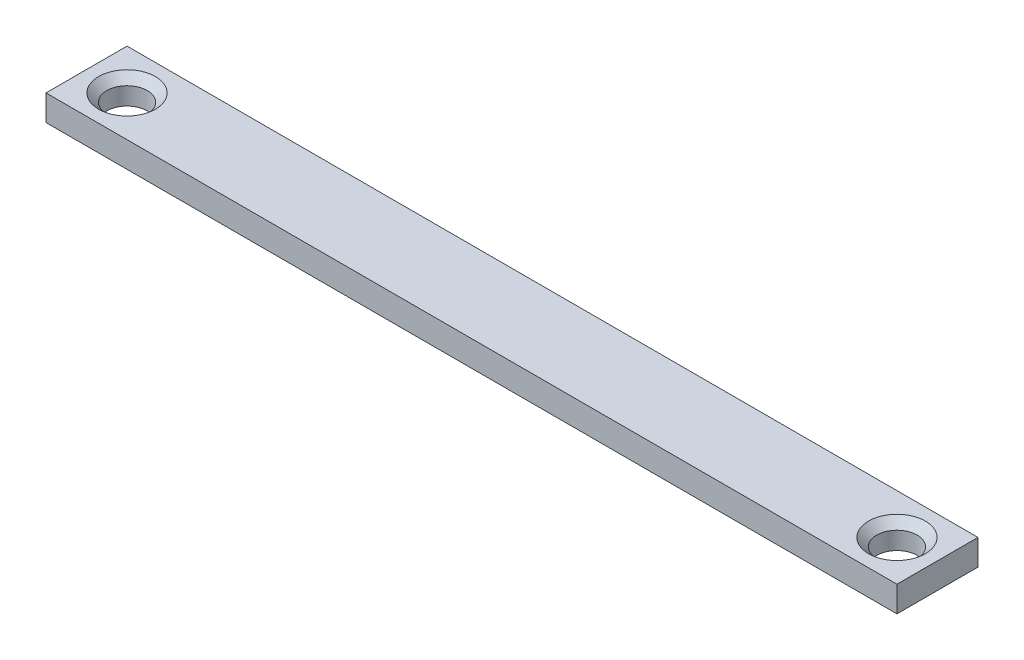
ISO-10303-21;
HEADER;
FILE_DESCRIPTION(('STEP AP214'),'2;1');
FILE_NAME('part.step','',(''),(''),'','','');
FILE_SCHEMA(('AUTOMOTIVE_DESIGN { 1 0 10303 214 1 1 1 1 }'));
ENDSEC;
DATA;
#1=APPLICATION_CONTEXT('core data for automotive mechanical design processes');
#2=APPLICATION_PROTOCOL_DEFINITION('international standard','automotive_design',2000,#1);
#3=PRODUCT_CONTEXT('',#1,'mechanical');
#4=PRODUCT('Part','Part','',(#3));
#5=PRODUCT_RELATED_PRODUCT_CATEGORY('part','',(#4));
#6=PRODUCT_DEFINITION_FORMATION('','',#4);
#7=PRODUCT_DEFINITION_CONTEXT('part definition',#1,'design');
#8=PRODUCT_DEFINITION('design','',#6,#7);
#9=PRODUCT_DEFINITION_SHAPE('','',#8);
#10=(LENGTH_UNIT() NAMED_UNIT(*) SI_UNIT(.MILLI.,.METRE.));
#11=(NAMED_UNIT(*) PLANE_ANGLE_UNIT() SI_UNIT($,.RADIAN.));
#12=(NAMED_UNIT(*) SI_UNIT($,.STERADIAN.) SOLID_ANGLE_UNIT());
#13=UNCERTAINTY_MEASURE_WITH_UNIT(LENGTH_MEASURE(1.E-05),#10,'distance_accuracy_value','');
#14=(GEOMETRIC_REPRESENTATION_CONTEXT(3) GLOBAL_UNCERTAINTY_ASSIGNED_CONTEXT((#13)) GLOBAL_UNIT_ASSIGNED_CONTEXT((#10,
#11,#12)) REPRESENTATION_CONTEXT('',''));
#15=CARTESIAN_POINT('',(0.,0.,0.));
#16=DIRECTION('',(0.,0.,1.));
#17=DIRECTION('',(1.,0.,0.));
#18=AXIS2_PLACEMENT_3D('',#15,#16,#17);
#19=CARTESIAN_POINT('',(0.,3.175,0.));
#20=DIRECTION('',(0.,-1.,0.));
#21=DIRECTION('',(0.,0.,-1.));
#22=AXIS2_PLACEMENT_3D('',#19,#20,#21);
#23=PLANE('',#22);
#24=CARTESIAN_POINT('',(47.5,3.175,0.));
#25=DIRECTION('',(0.,1.,0.));
#26=DIRECTION('',(0.,0.,1.));
#27=AXIS2_PLACEMENT_3D('',#24,#25,#26);
#28=CIRCLE('',#27,3.5);
#29=CARTESIAN_POINT('',(47.5,3.175,3.49999999999999));
#30=VERTEX_POINT('',#29);
#31=EDGE_CURVE('E140',#30,#30,#28,.T.);
#32=ORIENTED_EDGE('',*,*,#31,.F.);
#33=EDGE_LOOP('',(#32));
#34=FACE_BOUND('',#33,.T.);
#35=DIRECTION('',(0.,0.,-1.));
#36=VECTOR('',#35,1.);
#37=CARTESIAN_POINT('',(52.5,3.175,5.));
#38=LINE('',#37,#36);
#39=CARTESIAN_POINT('',(52.5,3.175,5.));
#40=VERTEX_POINT('',#39);
#41=CARTESIAN_POINT('',(52.5,3.175,-5.));
#42=VERTEX_POINT('',#41);
#43=EDGE_CURVE('E96',#40,#42,#38,.T.);
#44=ORIENTED_EDGE('',*,*,#43,.T.);
#45=DIRECTION('',(-1.,0.,0.));
#46=VECTOR('',#45,1.);
#47=CARTESIAN_POINT('',(-52.5,3.175,-5.));
#48=LINE('',#47,#46);
#49=CARTESIAN_POINT('',(-52.5,3.175,-5.));
#50=VERTEX_POINT('',#49);
#51=EDGE_CURVE('E91',#42,#50,#48,.T.);
#52=ORIENTED_EDGE('',*,*,#51,.T.);
#53=DIRECTION('',(0.,0.,1.));
#54=VECTOR('',#53,1.);
#55=CARTESIAN_POINT('',(-52.5,3.175,5.));
#56=LINE('',#55,#54);
#57=CARTESIAN_POINT('',(-52.5,3.175,5.));
#58=VERTEX_POINT('',#57);
#59=EDGE_CURVE('E94',#50,#58,#56,.T.);
#60=ORIENTED_EDGE('',*,*,#59,.T.);
#61=DIRECTION('',(1.,0.,0.));
#62=VECTOR('',#61,1.);
#63=CARTESIAN_POINT('',(-52.5,3.175,5.));
#64=LINE('',#63,#62);
#65=EDGE_CURVE('E61',#58,#40,#64,.T.);
#66=ORIENTED_EDGE('',*,*,#65,.T.);
#67=EDGE_LOOP('',(#44,#52,#60,#66));
#68=FACE_BOUND('',#67,.T.);
#69=CARTESIAN_POINT('',(-47.5,3.175,0.));
#70=DIRECTION('',(0.,1.,0.));
#71=DIRECTION('',(0.,0.,1.));
#72=AXIS2_PLACEMENT_3D('',#69,#70,#71);
#73=CIRCLE('',#72,3.5);
#74=CARTESIAN_POINT('',(-47.5,3.175,3.5));
#75=VERTEX_POINT('',#74);
#76=EDGE_CURVE('E152',#75,#75,#73,.T.);
#77=ORIENTED_EDGE('',*,*,#76,.F.);
#78=EDGE_LOOP('',(#77));
#79=FACE_BOUND('',#78,.T.);
#80=ADVANCED_FACE('F43',(#34,#68,#79),#23,.F.);
#81=CARTESIAN_POINT('',(52.5,3.175,5.));
#82=DIRECTION('',(-1.,0.,0.));
#83=DIRECTION('',(0.,0.,1.));
#84=AXIS2_PLACEMENT_3D('',#81,#82,#83);
#85=PLANE('',#84);
#86=DIRECTION('',(0.,0.,-1.));
#87=VECTOR('',#86,1.);
#88=CARTESIAN_POINT('',(52.5,0.,5.));
#89=LINE('',#88,#87);
#90=CARTESIAN_POINT('',(52.5,0.,5.));
#91=VERTEX_POINT('',#90);
#92=CARTESIAN_POINT('',(52.5,0.,-5.));
#93=VERTEX_POINT('',#92);
#94=EDGE_CURVE('E112',#91,#93,#89,.T.);
#95=ORIENTED_EDGE('',*,*,#94,.T.);
#96=DIRECTION('',(0.,-1.,0.));
#97=VECTOR('',#96,1.);
#98=CARTESIAN_POINT('',(52.5,3.175,-5.));
#99=LINE('',#98,#97);
#100=EDGE_CURVE('E11',#42,#93,#99,.T.);
#101=ORIENTED_EDGE('',*,*,#100,.F.);
#102=ORIENTED_EDGE('',*,*,#43,.F.);
#103=DIRECTION('',(0.,-1.,0.));
#104=VECTOR('',#103,1.);
#105=CARTESIAN_POINT('',(52.5,3.175,5.));
#106=LINE('',#105,#104);
#107=EDGE_CURVE('E108',#40,#91,#106,.T.);
#108=ORIENTED_EDGE('',*,*,#107,.T.);
#109=EDGE_LOOP('',(#95,#101,#102,#108));
#110=FACE_BOUND('',#109,.T.);
#111=ADVANCED_FACE('F45',(#110),#85,.F.);
#112=CARTESIAN_POINT('',(-52.5,3.175,-5.));
#113=DIRECTION('',(0.,0.,1.));
#114=DIRECTION('',(1.,0.,0.));
#115=AXIS2_PLACEMENT_3D('',#112,#113,#114);
#116=PLANE('',#115);
#117=DIRECTION('',(-1.,0.,0.));
#118=VECTOR('',#117,1.);
#119=CARTESIAN_POINT('',(-52.5,0.,-5.));
#120=LINE('',#119,#118);
#121=CARTESIAN_POINT('',(-52.5,0.,-5.));
#122=VERTEX_POINT('',#121);
#123=EDGE_CURVE('E101',#93,#122,#120,.T.);
#124=ORIENTED_EDGE('',*,*,#123,.T.);
#125=DIRECTION('',(0.,-1.,0.));
#126=VECTOR('',#125,1.);
#127=CARTESIAN_POINT('',(-52.5,3.175,-5.));
#128=LINE('',#127,#126);
#129=EDGE_CURVE('E53',#50,#122,#128,.T.);
#130=ORIENTED_EDGE('',*,*,#129,.F.);
#131=ORIENTED_EDGE('',*,*,#51,.F.);
#132=ORIENTED_EDGE('',*,*,#100,.T.);
#133=EDGE_LOOP('',(#124,#130,#131,#132));
#134=FACE_BOUND('',#133,.T.);
#135=ADVANCED_FACE('F100',(#134),#116,.F.);
#136=CARTESIAN_POINT('',(-52.5,3.175,5.));
#137=DIRECTION('',(1.,0.,0.));
#138=DIRECTION('',(0.,0.,-1.));
#139=AXIS2_PLACEMENT_3D('',#136,#137,#138);
#140=PLANE('',#139);
#141=DIRECTION('',(0.,0.,1.));
#142=VECTOR('',#141,1.);
#143=CARTESIAN_POINT('',(-52.5,0.,5.));
#144=LINE('',#143,#142);
#145=CARTESIAN_POINT('',(-52.5,0.,5.));
#146=VERTEX_POINT('',#145);
#147=EDGE_CURVE('E78',#122,#146,#144,.T.);
#148=ORIENTED_EDGE('',*,*,#147,.T.);
#149=DIRECTION('',(0.,-1.,0.));
#150=VECTOR('',#149,1.);
#151=CARTESIAN_POINT('',(-52.5,3.175,5.));
#152=LINE('',#151,#150);
#153=EDGE_CURVE('E103',#58,#146,#152,.T.);
#154=ORIENTED_EDGE('',*,*,#153,.F.);
#155=ORIENTED_EDGE('',*,*,#59,.F.);
#156=ORIENTED_EDGE('',*,*,#129,.T.);
#157=EDGE_LOOP('',(#148,#154,#155,#156));
#158=FACE_BOUND('',#157,.T.);
#159=ADVANCED_FACE('F104',(#158),#140,.F.);
#160=CARTESIAN_POINT('',(-52.5,3.175,5.));
#161=DIRECTION('',(0.,0.,-1.));
#162=DIRECTION('',(-1.,0.,0.));
#163=AXIS2_PLACEMENT_3D('',#160,#161,#162);
#164=PLANE('',#163);
#165=DIRECTION('',(1.,0.,0.));
#166=VECTOR('',#165,1.);
#167=CARTESIAN_POINT('',(-52.5,0.,5.));
#168=LINE('',#167,#166);
#169=EDGE_CURVE('E84',#146,#91,#168,.T.);
#170=ORIENTED_EDGE('',*,*,#169,.T.);
#171=ORIENTED_EDGE('',*,*,#107,.F.);
#172=ORIENTED_EDGE('',*,*,#65,.F.);
#173=ORIENTED_EDGE('',*,*,#153,.T.);
#174=EDGE_LOOP('',(#170,#171,#172,#173));
#175=FACE_BOUND('',#174,.T.);
#176=ADVANCED_FACE('F126',(#175),#164,.F.);
#177=CARTESIAN_POINT('',(0.,0.,0.));
#178=DIRECTION('',(0.,-1.,0.));
#179=DIRECTION('',(0.,0.,-1.));
#180=AXIS2_PLACEMENT_3D('',#177,#178,#179);
#181=PLANE('',#180);
#182=CARTESIAN_POINT('',(-47.5,0.,0.));
#183=DIRECTION('',(0.,-1.,0.));
#184=DIRECTION('',(0.,0.,-1.));
#185=AXIS2_PLACEMENT_3D('',#182,#183,#184);
#186=CIRCLE('',#185,2.5);
#187=CARTESIAN_POINT('',(-47.5,0.,-2.5));
#188=VERTEX_POINT('',#187);
#189=EDGE_CURVE('E144',#188,#188,#186,.T.);
#190=ORIENTED_EDGE('',*,*,#189,.F.);
#191=EDGE_LOOP('',(#190));
#192=FACE_BOUND('',#191,.T.);
#193=CARTESIAN_POINT('',(47.5,0.,0.));
#194=DIRECTION('',(0.,-1.,0.));
#195=DIRECTION('',(0.,0.,-1.));
#196=AXIS2_PLACEMENT_3D('',#193,#194,#195);
#197=CIRCLE('',#196,2.5);
#198=CARTESIAN_POINT('',(47.5,0.,-2.50000000000001));
#199=VERTEX_POINT('',#198);
#200=EDGE_CURVE('E116',#199,#199,#197,.T.);
#201=ORIENTED_EDGE('',*,*,#200,.F.);
#202=EDGE_LOOP('',(#201));
#203=FACE_BOUND('',#202,.T.);
#204=ORIENTED_EDGE('',*,*,#94,.F.);
#205=ORIENTED_EDGE('',*,*,#169,.F.);
#206=ORIENTED_EDGE('',*,*,#147,.F.);
#207=ORIENTED_EDGE('',*,*,#123,.F.);
#208=EDGE_LOOP('',(#204,#205,#206,#207));
#209=FACE_BOUND('',#208,.T.);
#210=ADVANCED_FACE('F129',(#192,#203,#209),#181,.T.);
#211=CARTESIAN_POINT('',(47.5,3.175,0.));
#212=DIRECTION('',(0.,1.,0.));
#213=DIRECTION('',(0.,0.,1.));
#214=AXIS2_PLACEMENT_3D('',#211,#212,#213);
#215=CYLINDRICAL_SURFACE('',#214,2.5);
#216=CARTESIAN_POINT('',(47.5,2.17499999999999,0.));
#217=DIRECTION('',(0.,1.,0.));
#218=DIRECTION('',(0.,0.,1.));
#219=AXIS2_PLACEMENT_3D('',#216,#217,#218);
#220=CIRCLE('',#219,2.49999999999999);
#221=CARTESIAN_POINT('',(47.5,2.17499999999999,2.49999999999997));
#222=VERTEX_POINT('',#221);
#223=EDGE_CURVE('E136',#222,#222,#220,.T.);
#224=ORIENTED_EDGE('',*,*,#223,.T.);
#225=EDGE_LOOP('',(#224));
#226=FACE_BOUND('',#225,.T.);
#227=ORIENTED_EDGE('',*,*,#200,.T.);
#228=EDGE_LOOP('',(#227));
#229=FACE_BOUND('',#228,.T.);
#230=ADVANCED_FACE('F167',(#226,#229),#215,.F.);
#231=CARTESIAN_POINT('',(47.5,3.175,0.));
#232=DIRECTION('',(0.,1.,0.));
#233=DIRECTION('',(0.,0.,1.));
#234=AXIS2_PLACEMENT_3D('',#231,#232,#233);
#235=CONICAL_SURFACE('',#234,3.5,0.785398163397447);
#236=ORIENTED_EDGE('',*,*,#223,.F.);
#237=EDGE_LOOP('',(#236));
#238=FACE_BOUND('',#237,.T.);
#239=ORIENTED_EDGE('',*,*,#31,.T.);
#240=EDGE_LOOP('',(#239));
#241=FACE_BOUND('',#240,.T.);
#242=ADVANCED_FACE('F198',(#238,#241),#235,.F.);
#243=CARTESIAN_POINT('',(-47.5,3.175,0.));
#244=DIRECTION('',(0.,1.,0.));
#245=DIRECTION('',(0.,0.,1.));
#246=AXIS2_PLACEMENT_3D('',#243,#244,#245);
#247=CYLINDRICAL_SURFACE('',#246,2.5);
#248=CARTESIAN_POINT('',(-47.5,2.17499999999999,0.));
#249=DIRECTION('',(0.,1.,0.));
#250=DIRECTION('',(0.,0.,1.));
#251=AXIS2_PLACEMENT_3D('',#248,#249,#250);
#252=CIRCLE('',#251,2.49999999999999);
#253=CARTESIAN_POINT('',(-47.5,2.17499999999999,2.49999999999999));
#254=VERTEX_POINT('',#253);
#255=EDGE_CURVE('E148',#254,#254,#252,.T.);
#256=ORIENTED_EDGE('',*,*,#255,.T.);
#257=EDGE_LOOP('',(#256));
#258=FACE_BOUND('',#257,.T.);
#259=ORIENTED_EDGE('',*,*,#189,.T.);
#260=EDGE_LOOP('',(#259));
#261=FACE_BOUND('',#260,.T.);
#262=ADVANCED_FACE('F205',(#258,#261),#247,.F.);
#263=CARTESIAN_POINT('',(-47.5,3.175,0.));
#264=DIRECTION('',(0.,1.,0.));
#265=DIRECTION('',(0.,0.,1.));
#266=AXIS2_PLACEMENT_3D('',#263,#264,#265);
#267=CONICAL_SURFACE('',#266,3.5,0.785398163397447);
#268=ORIENTED_EDGE('',*,*,#255,.F.);
#269=EDGE_LOOP('',(#268));
#270=FACE_BOUND('',#269,.T.);
#271=ORIENTED_EDGE('',*,*,#76,.T.);
#272=EDGE_LOOP('',(#271));
#273=FACE_BOUND('',#272,.T.);
#274=ADVANCED_FACE('F157',(#270,#273),#267,.F.);
#275=CLOSED_SHELL('',(#80,#111,#135,#159,#176,#210,#230,#242,#262,#274));
#276=MANIFOLD_SOLID_BREP('B2',#275);
#277=ADVANCED_BREP_SHAPE_REPRESENTATION('',(#18,#276),#14);
#278=SHAPE_DEFINITION_REPRESENTATION(#9,#277);
ENDSEC;
END-ISO-10303-21;
